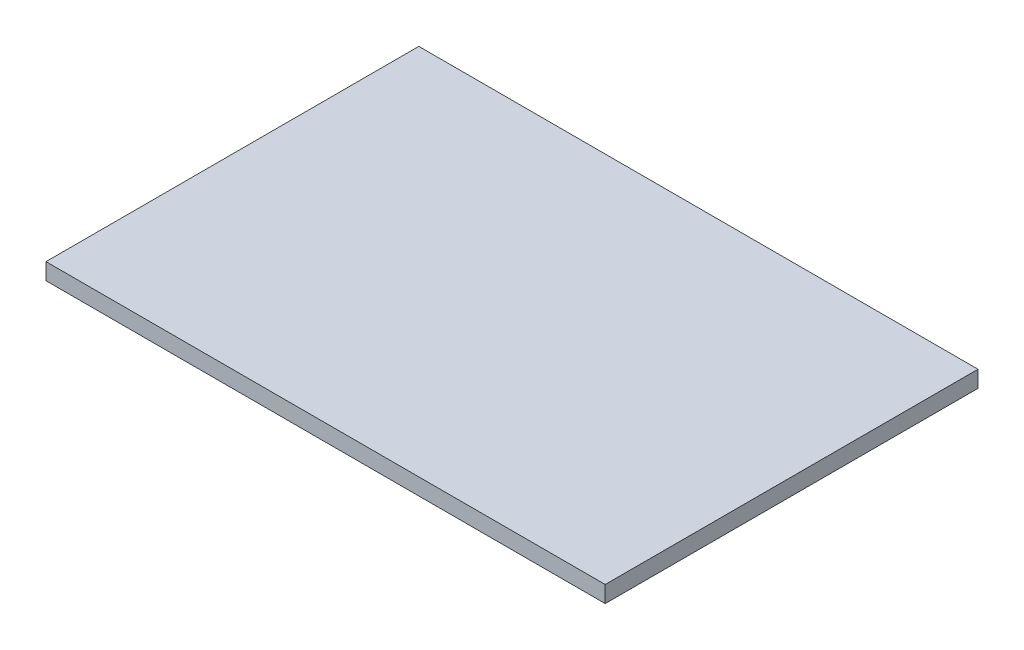
ISO-10303-21;
HEADER;
FILE_DESCRIPTION(('STEP AP214'),'2;1');
FILE_NAME('part.step','',(''),(''),'','','');
FILE_SCHEMA(('AUTOMOTIVE_DESIGN { 1 0 10303 214 1 1 1 1 }'));
ENDSEC;
DATA;
#1=APPLICATION_CONTEXT('core data for automotive mechanical design processes');
#2=APPLICATION_PROTOCOL_DEFINITION('international standard','automotive_design',2000,#1);
#3=PRODUCT_CONTEXT('',#1,'mechanical');
#4=PRODUCT('Part','Part','',(#3));
#5=PRODUCT_RELATED_PRODUCT_CATEGORY('part','',(#4));
#6=PRODUCT_DEFINITION_FORMATION('','',#4);
#7=PRODUCT_DEFINITION_CONTEXT('part definition',#1,'design');
#8=PRODUCT_DEFINITION('design','',#6,#7);
#9=PRODUCT_DEFINITION_SHAPE('','',#8);
#10=(LENGTH_UNIT() NAMED_UNIT(*) SI_UNIT(.MILLI.,.METRE.));
#11=(NAMED_UNIT(*) PLANE_ANGLE_UNIT() SI_UNIT($,.RADIAN.));
#12=(NAMED_UNIT(*) SI_UNIT($,.STERADIAN.) SOLID_ANGLE_UNIT());
#13=UNCERTAINTY_MEASURE_WITH_UNIT(LENGTH_MEASURE(1.E-05),#10,'distance_accuracy_value','');
#14=(GEOMETRIC_REPRESENTATION_CONTEXT(3) GLOBAL_UNCERTAINTY_ASSIGNED_CONTEXT((#13)) GLOBAL_UNIT_ASSIGNED_CONTEXT((#10,
#11,#12)) REPRESENTATION_CONTEXT('',''));
#15=CARTESIAN_POINT('',(0.,0.,0.));
#16=DIRECTION('',(0.,0.,1.));
#17=DIRECTION('',(1.,0.,0.));
#18=AXIS2_PLACEMENT_3D('',#15,#16,#17);
#19=CARTESIAN_POINT('',(-42.8625,2.54,28.575));
#20=DIRECTION('',(1.,0.,0.));
#21=DIRECTION('',(0.,0.,-1.));
#22=AXIS2_PLACEMENT_3D('',#19,#20,#21);
#23=PLANE('',#22);
#24=DIRECTION('',(0.,0.,1.));
#25=VECTOR('',#24,1.);
#26=CARTESIAN_POINT('',(-42.8625,0.,28.575));
#27=LINE('',#26,#25);
#28=CARTESIAN_POINT('',(-42.8625,0.,-28.575));
#29=VERTEX_POINT('',#28);
#30=CARTESIAN_POINT('',(-42.8625,0.,28.575));
#31=VERTEX_POINT('',#30);
#32=EDGE_CURVE('E95',#29,#31,#27,.T.);
#33=ORIENTED_EDGE('',*,*,#32,.T.);
#34=DIRECTION('',(0.,-1.,0.));
#35=VECTOR('',#34,1.);
#36=CARTESIAN_POINT('',(-42.8625,2.54,28.575));
#37=LINE('',#36,#35);
#38=CARTESIAN_POINT('',(-42.8625,2.54,28.575));
#39=VERTEX_POINT('',#38);
#40=EDGE_CURVE('E11',#39,#31,#37,.T.);
#41=ORIENTED_EDGE('',*,*,#40,.F.);
#42=DIRECTION('',(0.,0.,1.));
#43=VECTOR('',#42,1.);
#44=CARTESIAN_POINT('',(-42.8625,2.54,28.575));
#45=LINE('',#44,#43);
#46=CARTESIAN_POINT('',(-42.8625,2.54,-28.575));
#47=VERTEX_POINT('',#46);
#48=EDGE_CURVE('E83',#47,#39,#45,.T.);
#49=ORIENTED_EDGE('',*,*,#48,.F.);
#50=DIRECTION('',(0.,-1.,0.));
#51=VECTOR('',#50,1.);
#52=CARTESIAN_POINT('',(-42.8625,2.54,-28.575));
#53=LINE('',#52,#51);
#54=EDGE_CURVE('E91',#47,#29,#53,.T.);
#55=ORIENTED_EDGE('',*,*,#54,.T.);
#56=EDGE_LOOP('',(#33,#41,#49,#55));
#57=FACE_BOUND('',#56,.T.);
#58=ADVANCED_FACE('F32',(#57),#23,.F.);
#59=CARTESIAN_POINT('',(42.8625,2.54,28.575));
#60=DIRECTION('',(0.,0.,-1.));
#61=DIRECTION('',(-1.,0.,0.));
#62=AXIS2_PLACEMENT_3D('',#59,#60,#61);
#63=PLANE('',#62);
#64=DIRECTION('',(1.,0.,0.));
#65=VECTOR('',#64,1.);
#66=CARTESIAN_POINT('',(42.8625,0.,28.575));
#67=LINE('',#66,#65);
#68=CARTESIAN_POINT('',(42.8625,0.,28.575));
#69=VERTEX_POINT('',#68);
#70=EDGE_CURVE('E87',#31,#69,#67,.T.);
#71=ORIENTED_EDGE('',*,*,#70,.T.);
#72=DIRECTION('',(0.,-1.,0.));
#73=VECTOR('',#72,1.);
#74=CARTESIAN_POINT('',(42.8625,2.54,28.575));
#75=LINE('',#74,#73);
#76=CARTESIAN_POINT('',(42.8625,2.54,28.575));
#77=VERTEX_POINT('',#76);
#78=EDGE_CURVE('E40',#77,#69,#75,.T.);
#79=ORIENTED_EDGE('',*,*,#78,.F.);
#80=DIRECTION('',(1.,0.,0.));
#81=VECTOR('',#80,1.);
#82=CARTESIAN_POINT('',(42.8625,2.54,28.575));
#83=LINE('',#82,#81);
#84=EDGE_CURVE('E78',#39,#77,#83,.T.);
#85=ORIENTED_EDGE('',*,*,#84,.F.);
#86=ORIENTED_EDGE('',*,*,#40,.T.);
#87=EDGE_LOOP('',(#71,#79,#85,#86));
#88=FACE_BOUND('',#87,.T.);
#89=ADVANCED_FACE('F86',(#88),#63,.F.);
#90=CARTESIAN_POINT('',(42.8625,2.54,28.575));
#91=DIRECTION('',(-1.,0.,0.));
#92=DIRECTION('',(0.,0.,1.));
#93=AXIS2_PLACEMENT_3D('',#90,#91,#92);
#94=PLANE('',#93);
#95=DIRECTION('',(0.,0.,-1.));
#96=VECTOR('',#95,1.);
#97=CARTESIAN_POINT('',(42.8625,0.,28.575));
#98=LINE('',#97,#96);
#99=CARTESIAN_POINT('',(42.8625,0.,-28.575));
#100=VERTEX_POINT('',#99);
#101=EDGE_CURVE('E65',#69,#100,#98,.T.);
#102=ORIENTED_EDGE('',*,*,#101,.T.);
#103=DIRECTION('',(0.,-1.,0.));
#104=VECTOR('',#103,1.);
#105=CARTESIAN_POINT('',(42.8625,2.54,-28.575));
#106=LINE('',#105,#104);
#107=CARTESIAN_POINT('',(42.8625,2.54,-28.575));
#108=VERTEX_POINT('',#107);
#109=EDGE_CURVE('E88',#108,#100,#106,.T.);
#110=ORIENTED_EDGE('',*,*,#109,.F.);
#111=DIRECTION('',(0.,0.,-1.));
#112=VECTOR('',#111,1.);
#113=CARTESIAN_POINT('',(42.8625,2.54,28.575));
#114=LINE('',#113,#112);
#115=EDGE_CURVE('E81',#77,#108,#114,.T.);
#116=ORIENTED_EDGE('',*,*,#115,.F.);
#117=ORIENTED_EDGE('',*,*,#78,.T.);
#118=EDGE_LOOP('',(#102,#110,#116,#117));
#119=FACE_BOUND('',#118,.T.);
#120=ADVANCED_FACE('F89',(#119),#94,.F.);
#121=CARTESIAN_POINT('',(42.8625,2.54,-28.575));
#122=DIRECTION('',(0.,0.,1.));
#123=DIRECTION('',(1.,0.,0.));
#124=AXIS2_PLACEMENT_3D('',#121,#122,#123);
#125=PLANE('',#124);
#126=DIRECTION('',(-1.,0.,0.));
#127=VECTOR('',#126,1.);
#128=CARTESIAN_POINT('',(42.8625,0.,-28.575));
#129=LINE('',#128,#127);
#130=EDGE_CURVE('E71',#100,#29,#129,.T.);
#131=ORIENTED_EDGE('',*,*,#130,.T.);
#132=ORIENTED_EDGE('',*,*,#54,.F.);
#133=DIRECTION('',(-1.,0.,0.));
#134=VECTOR('',#133,1.);
#135=CARTESIAN_POINT('',(42.8625,2.54,-28.575));
#136=LINE('',#135,#134);
#137=EDGE_CURVE('E48',#108,#47,#136,.T.);
#138=ORIENTED_EDGE('',*,*,#137,.F.);
#139=ORIENTED_EDGE('',*,*,#109,.T.);
#140=EDGE_LOOP('',(#131,#132,#138,#139));
#141=FACE_BOUND('',#140,.T.);
#142=ADVANCED_FACE('F102',(#141),#125,.F.);
#143=CARTESIAN_POINT('',(0.,2.54,0.));
#144=DIRECTION('',(0.,1.,0.));
#145=DIRECTION('',(0.,0.,1.));
#146=AXIS2_PLACEMENT_3D('',#143,#144,#145);
#147=PLANE('',#146);
#148=ORIENTED_EDGE('',*,*,#48,.T.);
#149=ORIENTED_EDGE('',*,*,#84,.T.);
#150=ORIENTED_EDGE('',*,*,#115,.T.);
#151=ORIENTED_EDGE('',*,*,#137,.T.);
#152=EDGE_LOOP('',(#148,#149,#150,#151));
#153=FACE_BOUND('',#152,.T.);
#154=ADVANCED_FACE('F79',(#153),#147,.T.);
#155=CARTESIAN_POINT('',(0.,0.,0.));
#156=DIRECTION('',(0.,1.,0.));
#157=DIRECTION('',(0.,0.,1.));
#158=AXIS2_PLACEMENT_3D('',#155,#156,#157);
#159=PLANE('',#158);
#160=ORIENTED_EDGE('',*,*,#32,.F.);
#161=ORIENTED_EDGE('',*,*,#130,.F.);
#162=ORIENTED_EDGE('',*,*,#101,.F.);
#163=ORIENTED_EDGE('',*,*,#70,.F.);
#164=EDGE_LOOP('',(#160,#161,#162,#163));
#165=FACE_BOUND('',#164,.T.);
#166=ADVANCED_FACE('F105',(#165),#159,.F.);
#167=CLOSED_SHELL('',(#58,#89,#120,#142,#154,#166));
#168=MANIFOLD_SOLID_BREP('B2',#167);
#169=ADVANCED_BREP_SHAPE_REPRESENTATION('',(#18,#168),#14);
#170=SHAPE_DEFINITION_REPRESENTATION(#9,#169);
ENDSEC;
END-ISO-10303-21;
